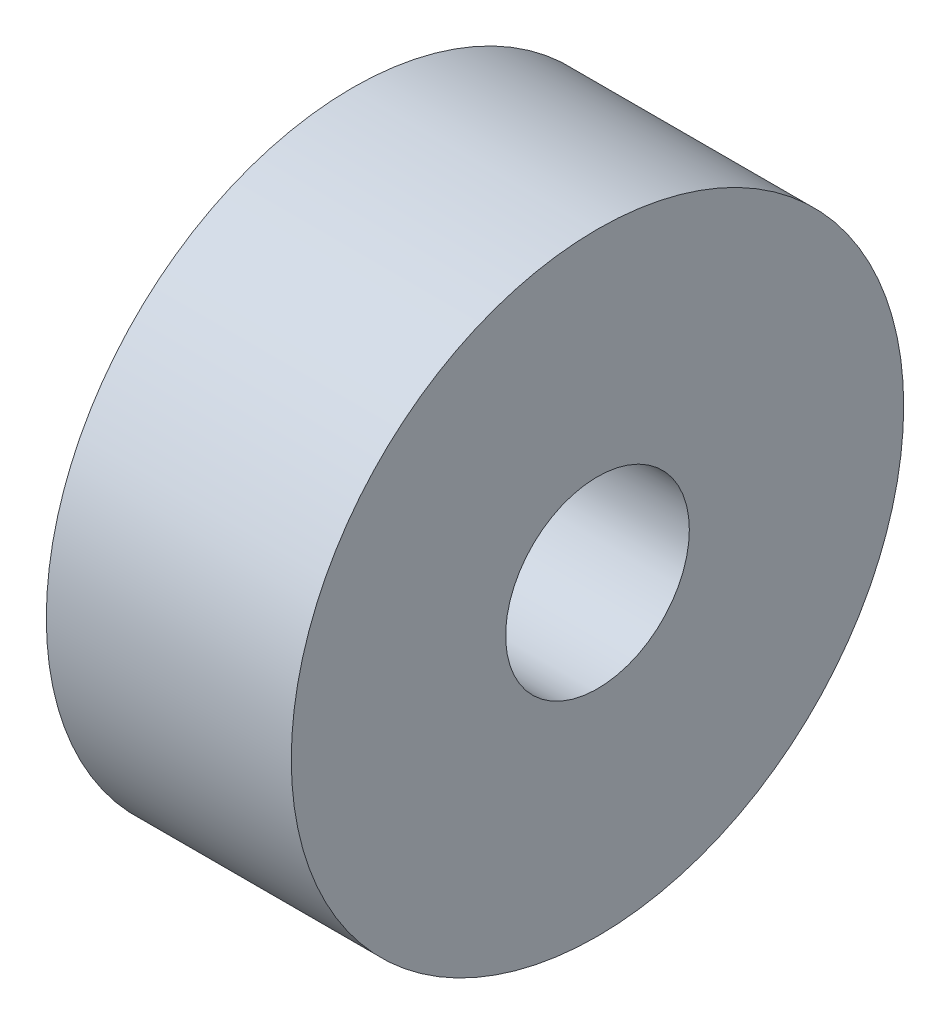
ISO-10303-21;
HEADER;
FILE_DESCRIPTION(('STEP AP214'),'2;1');
FILE_NAME('part.step','',(''),(''),'','','');
FILE_SCHEMA(('AUTOMOTIVE_DESIGN { 1 0 10303 214 1 1 1 1 }'));
ENDSEC;
DATA;
#1=APPLICATION_CONTEXT('core data for automotive mechanical design processes');
#2=APPLICATION_PROTOCOL_DEFINITION('international standard','automotive_design',2000,#1);
#3=PRODUCT_CONTEXT('',#1,'mechanical');
#4=PRODUCT('Part','Part','',(#3));
#5=PRODUCT_RELATED_PRODUCT_CATEGORY('part','',(#4));
#6=PRODUCT_DEFINITION_FORMATION('','',#4);
#7=PRODUCT_DEFINITION_CONTEXT('part definition',#1,'design');
#8=PRODUCT_DEFINITION('design','',#6,#7);
#9=PRODUCT_DEFINITION_SHAPE('','',#8);
#10=(LENGTH_UNIT() NAMED_UNIT(*) SI_UNIT(.MILLI.,.METRE.));
#11=(NAMED_UNIT(*) PLANE_ANGLE_UNIT() SI_UNIT($,.RADIAN.));
#12=(NAMED_UNIT(*) SI_UNIT($,.STERADIAN.) SOLID_ANGLE_UNIT());
#13=UNCERTAINTY_MEASURE_WITH_UNIT(LENGTH_MEASURE(1.E-05),#10,'distance_accuracy_value','');
#14=(GEOMETRIC_REPRESENTATION_CONTEXT(3) GLOBAL_UNCERTAINTY_ASSIGNED_CONTEXT((#13)) GLOBAL_UNIT_ASSIGNED_CONTEXT((#10,
#11,#12)) REPRESENTATION_CONTEXT('',''));
#15=CARTESIAN_POINT('',(0.,0.,0.));
#16=DIRECTION('',(0.,0.,1.));
#17=DIRECTION('',(1.,0.,0.));
#18=AXIS2_PLACEMENT_3D('',#15,#16,#17);
#19=CARTESIAN_POINT('',(0.,0.,0.));
#20=DIRECTION('',(1.,0.,0.));
#21=DIRECTION('',(0.,0.,-1.));
#22=AXIS2_PLACEMENT_3D('',#19,#20,#21);
#23=PLANE('',#22);
#24=CARTESIAN_POINT('',(0.,0.,0.));
#25=DIRECTION('',(1.,0.,0.));
#26=DIRECTION('',(0.,0.,-1.));
#27=AXIS2_PLACEMENT_3D('',#24,#25,#26);
#28=CIRCLE('',#27,1.5);
#29=CARTESIAN_POINT('',(0.,0.,-1.5));
#30=VERTEX_POINT('',#29);
#31=EDGE_CURVE('E45',#30,#30,#28,.T.);
#32=ORIENTED_EDGE('',*,*,#31,.T.);
#33=EDGE_LOOP('',(#32));
#34=FACE_BOUND('',#33,.T.);
#35=CARTESIAN_POINT('',(0.,0.,0.));
#36=DIRECTION('',(-1.,0.,0.));
#37=DIRECTION('',(0.,0.,1.));
#38=AXIS2_PLACEMENT_3D('',#35,#36,#37);
#39=CIRCLE('',#38,5.);
#40=CARTESIAN_POINT('',(0.,0.,5.));
#41=VERTEX_POINT('',#40);
#42=EDGE_CURVE('E10',#41,#41,#39,.T.);
#43=ORIENTED_EDGE('',*,*,#42,.T.);
#44=EDGE_LOOP('',(#43));
#45=FACE_BOUND('',#44,.T.);
#46=ADVANCED_FACE('F31',(#34,#45),#23,.F.);
#47=CARTESIAN_POINT('',(-2.50811556246119,0.,0.));
#48=DIRECTION('',(-1.,0.,0.));
#49=DIRECTION('',(0.,0.,1.));
#50=AXIS2_PLACEMENT_3D('',#47,#48,#49);
#51=CYLINDRICAL_SURFACE('',#50,5.);
#52=ORIENTED_EDGE('',*,*,#42,.F.);
#53=EDGE_LOOP('',(#52));
#54=FACE_BOUND('',#53,.T.);
#55=CARTESIAN_POINT('',(4.,0.,0.));
#56=DIRECTION('',(-1.,0.,0.));
#57=DIRECTION('',(0.,0.,1.));
#58=AXIS2_PLACEMENT_3D('',#55,#56,#57);
#59=CIRCLE('',#58,5.);
#60=CARTESIAN_POINT('',(4.,0.,5.));
#61=VERTEX_POINT('',#60);
#62=EDGE_CURVE('E37',#61,#61,#59,.T.);
#63=ORIENTED_EDGE('',*,*,#62,.T.);
#64=EDGE_LOOP('',(#63));
#65=FACE_BOUND('',#64,.T.);
#66=ADVANCED_FACE('F60',(#54,#65),#51,.T.);
#67=CARTESIAN_POINT('',(4.,0.,0.));
#68=DIRECTION('',(-1.,0.,0.));
#69=DIRECTION('',(0.,0.,1.));
#70=AXIS2_PLACEMENT_3D('',#67,#68,#69);
#71=PLANE('',#70);
#72=CARTESIAN_POINT('',(4.,0.,0.));
#73=DIRECTION('',(1.,0.,0.));
#74=DIRECTION('',(0.,0.,-1.));
#75=AXIS2_PLACEMENT_3D('',#72,#73,#74);
#76=CIRCLE('',#75,1.5);
#77=CARTESIAN_POINT('',(4.,0.,-1.5));
#78=VERTEX_POINT('',#77);
#79=EDGE_CURVE('E41',#78,#78,#76,.T.);
#80=ORIENTED_EDGE('',*,*,#79,.F.);
#81=EDGE_LOOP('',(#80));
#82=FACE_BOUND('',#81,.T.);
#83=ORIENTED_EDGE('',*,*,#62,.F.);
#84=EDGE_LOOP('',(#83));
#85=FACE_BOUND('',#84,.T.);
#86=ADVANCED_FACE('F54',(#82,#85),#71,.F.);
#87=CARTESIAN_POINT('',(4.,0.,0.));
#88=DIRECTION('',(-1.,0.,0.));
#89=DIRECTION('',(0.,0.,1.));
#90=AXIS2_PLACEMENT_3D('',#87,#88,#89);
#91=CYLINDRICAL_SURFACE('',#90,1.5);
#92=ORIENTED_EDGE('',*,*,#79,.T.);
#93=EDGE_LOOP('',(#92));
#94=FACE_BOUND('',#93,.T.);
#95=ORIENTED_EDGE('',*,*,#31,.F.);
#96=EDGE_LOOP('',(#95));
#97=FACE_BOUND('',#96,.T.);
#98=ADVANCED_FACE('F52',(#94,#97),#91,.F.);
#99=CLOSED_SHELL('',(#46,#66,#86,#98));
#100=MANIFOLD_SOLID_BREP('B2',#99);
#101=ADVANCED_BREP_SHAPE_REPRESENTATION('',(#18,#100),#14);
#102=SHAPE_DEFINITION_REPRESENTATION(#9,#101);
ENDSEC;
END-ISO-10303-21;
